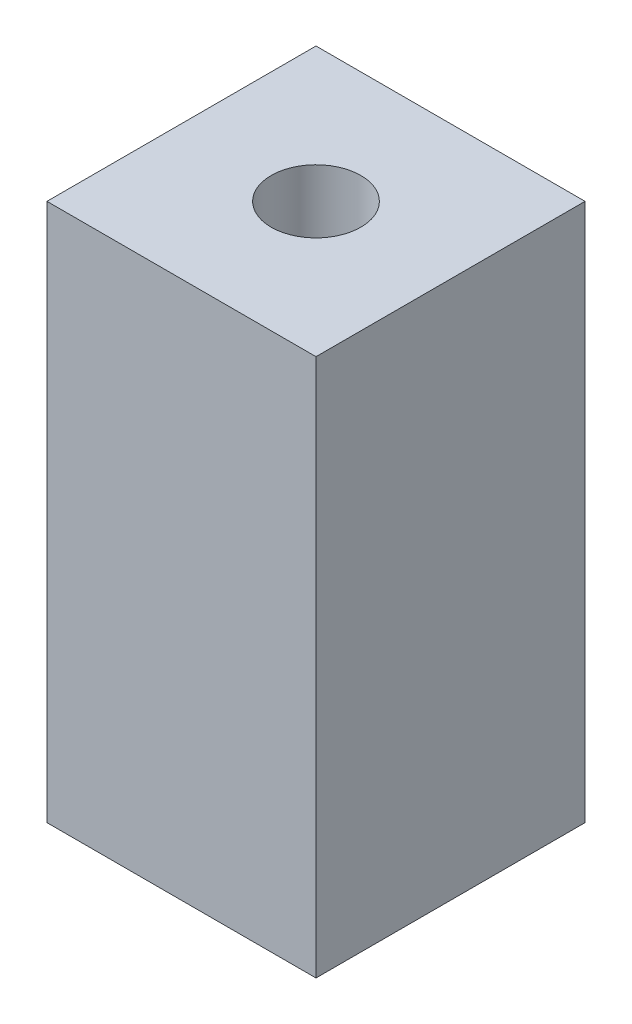
ISO-10303-21;
HEADER;
FILE_DESCRIPTION(('STEP AP214'),'2;1');
FILE_NAME('part.step','',(''),(''),'','','');
FILE_SCHEMA(('AUTOMOTIVE_DESIGN { 1 0 10303 214 1 1 1 1 }'));
ENDSEC;
DATA;
#1=APPLICATION_CONTEXT('core data for automotive mechanical design processes');
#2=APPLICATION_PROTOCOL_DEFINITION('international standard','automotive_design',2000,#1);
#3=PRODUCT_CONTEXT('',#1,'mechanical');
#4=PRODUCT('Part','Part','',(#3));
#5=PRODUCT_RELATED_PRODUCT_CATEGORY('part','',(#4));
#6=PRODUCT_DEFINITION_FORMATION('','',#4);
#7=PRODUCT_DEFINITION_CONTEXT('part definition',#1,'design');
#8=PRODUCT_DEFINITION('design','',#6,#7);
#9=PRODUCT_DEFINITION_SHAPE('','',#8);
#10=(LENGTH_UNIT() NAMED_UNIT(*) SI_UNIT(.MILLI.,.METRE.));
#11=(NAMED_UNIT(*) PLANE_ANGLE_UNIT() SI_UNIT($,.RADIAN.));
#12=(NAMED_UNIT(*) SI_UNIT($,.STERADIAN.) SOLID_ANGLE_UNIT());
#13=UNCERTAINTY_MEASURE_WITH_UNIT(LENGTH_MEASURE(1.E-05),#10,'distance_accuracy_value','');
#14=(GEOMETRIC_REPRESENTATION_CONTEXT(3) GLOBAL_UNCERTAINTY_ASSIGNED_CONTEXT((#13)) GLOBAL_UNIT_ASSIGNED_CONTEXT((#10,
#11,#12)) REPRESENTATION_CONTEXT('',''));
#15=CARTESIAN_POINT('',(0.,0.,0.));
#16=DIRECTION('',(0.,0.,1.));
#17=DIRECTION('',(1.,0.,0.));
#18=AXIS2_PLACEMENT_3D('',#15,#16,#17);
#19=CARTESIAN_POINT('',(0.,38.1,0.));
#20=DIRECTION('',(0.,1.,0.));
#21=DIRECTION('',(0.,0.,1.));
#22=AXIS2_PLACEMENT_3D('',#19,#20,#21);
#23=PLANE('',#22);
#24=DIRECTION('',(0.,0.,1.));
#25=VECTOR('',#24,1.);
#26=CARTESIAN_POINT('',(-9.52499999999999,38.1,9.525));
#27=LINE('',#26,#25);
#28=CARTESIAN_POINT('',(-9.52499999999999,38.1,-9.525));
#29=VERTEX_POINT('',#28);
#30=CARTESIAN_POINT('',(-9.52499999999999,38.1,9.525));
#31=VERTEX_POINT('',#30);
#32=EDGE_CURVE('E84',#29,#31,#27,.T.);
#33=ORIENTED_EDGE('',*,*,#32,.T.);
#34=DIRECTION('',(1.,0.,0.));
#35=VECTOR('',#34,1.);
#36=CARTESIAN_POINT('',(9.52500000000001,38.1,9.525));
#37=LINE('',#36,#35);
#38=CARTESIAN_POINT('',(9.52500000000001,38.1,9.525));
#39=VERTEX_POINT('',#38);
#40=EDGE_CURVE('E79',#31,#39,#37,.T.);
#41=ORIENTED_EDGE('',*,*,#40,.T.);
#42=DIRECTION('',(0.,0.,-1.));
#43=VECTOR('',#42,1.);
#44=CARTESIAN_POINT('',(9.52500000000001,38.1,9.525));
#45=LINE('',#44,#43);
#46=CARTESIAN_POINT('',(9.52500000000001,38.1,-9.525));
#47=VERTEX_POINT('',#46);
#48=EDGE_CURVE('E82',#39,#47,#45,.T.);
#49=ORIENTED_EDGE('',*,*,#48,.T.);
#50=DIRECTION('',(-1.,0.,0.));
#51=VECTOR('',#50,1.);
#52=CARTESIAN_POINT('',(9.52500000000001,38.1,-9.525));
#53=LINE('',#52,#51);
#54=EDGE_CURVE('E49',#47,#29,#53,.T.);
#55=ORIENTED_EDGE('',*,*,#54,.T.);
#56=EDGE_LOOP('',(#33,#41,#49,#55));
#57=FACE_BOUND('',#56,.T.);
#58=CARTESIAN_POINT('',(0.,38.1,0.));
#59=DIRECTION('',(0.,1.,0.));
#60=DIRECTION('',(0.,0.,1.));
#61=AXIS2_PLACEMENT_3D('',#58,#59,#60);
#62=CIRCLE('',#61,3.175);
#63=CARTESIAN_POINT('',(0.,38.1,3.175));
#64=VERTEX_POINT('',#63);
#65=EDGE_CURVE('E99',#64,#64,#62,.T.);
#66=ORIENTED_EDGE('',*,*,#65,.F.);
#67=EDGE_LOOP('',(#66));
#68=FACE_BOUND('',#67,.T.);
#69=ADVANCED_FACE('F32',(#57,#68),#23,.T.);
#70=CARTESIAN_POINT('',(0.,0.,0.));
#71=DIRECTION('',(0.,1.,0.));
#72=DIRECTION('',(0.,0.,1.));
#73=AXIS2_PLACEMENT_3D('',#70,#71,#72);
#74=PLANE('',#73);
#75=DIRECTION('',(0.,0.,1.));
#76=VECTOR('',#75,1.);
#77=CARTESIAN_POINT('',(-9.52499999999999,0.,9.525));
#78=LINE('',#77,#76);
#79=CARTESIAN_POINT('',(-9.52499999999999,0.,-9.525));
#80=VERTEX_POINT('',#79);
#81=CARTESIAN_POINT('',(-9.52499999999999,0.,9.525));
#82=VERTEX_POINT('',#81);
#83=EDGE_CURVE('E96',#80,#82,#78,.T.);
#84=ORIENTED_EDGE('',*,*,#83,.F.);
#85=DIRECTION('',(-1.,0.,0.));
#86=VECTOR('',#85,1.);
#87=CARTESIAN_POINT('',(9.52500000000001,0.,-9.525));
#88=LINE('',#87,#86);
#89=CARTESIAN_POINT('',(9.52500000000001,0.,-9.525));
#90=VERTEX_POINT('',#89);
#91=EDGE_CURVE('E72',#90,#80,#88,.T.);
#92=ORIENTED_EDGE('',*,*,#91,.F.);
#93=DIRECTION('',(0.,0.,-1.));
#94=VECTOR('',#93,1.);
#95=CARTESIAN_POINT('',(9.52500000000001,0.,9.525));
#96=LINE('',#95,#94);
#97=CARTESIAN_POINT('',(9.52500000000001,0.,9.525));
#98=VERTEX_POINT('',#97);
#99=EDGE_CURVE('E66',#98,#90,#96,.T.);
#100=ORIENTED_EDGE('',*,*,#99,.F.);
#101=DIRECTION('',(1.,0.,0.));
#102=VECTOR('',#101,1.);
#103=CARTESIAN_POINT('',(9.52500000000001,0.,9.525));
#104=LINE('',#103,#102);
#105=EDGE_CURVE('E88',#82,#98,#104,.T.);
#106=ORIENTED_EDGE('',*,*,#105,.F.);
#107=EDGE_LOOP('',(#84,#92,#100,#106));
#108=FACE_BOUND('',#107,.T.);
#109=CARTESIAN_POINT('',(0.,0.,0.));
#110=DIRECTION('',(0.,1.,0.));
#111=DIRECTION('',(0.,0.,1.));
#112=AXIS2_PLACEMENT_3D('',#109,#110,#111);
#113=CIRCLE('',#112,3.175);
#114=CARTESIAN_POINT('',(0.,0.,3.175));
#115=VERTEX_POINT('',#114);
#116=EDGE_CURVE('E111',#115,#115,#113,.T.);
#117=ORIENTED_EDGE('',*,*,#116,.T.);
#118=EDGE_LOOP('',(#117));
#119=FACE_BOUND('',#118,.T.);
#120=ADVANCED_FACE('F107',(#108,#119),#74,.F.);
#121=CARTESIAN_POINT('',(-9.52499999999999,38.1,9.525));
#122=DIRECTION('',(1.,0.,0.));
#123=DIRECTION('',(0.,0.,-1.));
#124=AXIS2_PLACEMENT_3D('',#121,#122,#123);
#125=PLANE('',#124);
#126=ORIENTED_EDGE('',*,*,#83,.T.);
#127=DIRECTION('',(0.,-1.,0.));
#128=VECTOR('',#127,1.);
#129=CARTESIAN_POINT('',(-9.52499999999999,38.1,9.525));
#130=LINE('',#129,#128);
#131=EDGE_CURVE('E11',#31,#82,#130,.T.);
#132=ORIENTED_EDGE('',*,*,#131,.F.);
#133=ORIENTED_EDGE('',*,*,#32,.F.);
#134=DIRECTION('',(0.,-1.,0.));
#135=VECTOR('',#134,1.);
#136=CARTESIAN_POINT('',(-9.52499999999999,38.1,-9.525));
#137=LINE('',#136,#135);
#138=EDGE_CURVE('E92',#29,#80,#137,.T.);
#139=ORIENTED_EDGE('',*,*,#138,.T.);
#140=EDGE_LOOP('',(#126,#132,#133,#139));
#141=FACE_BOUND('',#140,.T.);
#142=ADVANCED_FACE('F34',(#141),#125,.F.);
#143=CARTESIAN_POINT('',(9.52500000000001,38.1,9.525));
#144=DIRECTION('',(0.,0.,-1.));
#145=DIRECTION('',(-1.,0.,0.));
#146=AXIS2_PLACEMENT_3D('',#143,#144,#145);
#147=PLANE('',#146);
#148=ORIENTED_EDGE('',*,*,#105,.T.);
#149=DIRECTION('',(0.,-1.,0.));
#150=VECTOR('',#149,1.);
#151=CARTESIAN_POINT('',(9.52500000000001,38.1,9.525));
#152=LINE('',#151,#150);
#153=EDGE_CURVE('E41',#39,#98,#152,.T.);
#154=ORIENTED_EDGE('',*,*,#153,.F.);
#155=ORIENTED_EDGE('',*,*,#40,.F.);
#156=ORIENTED_EDGE('',*,*,#131,.T.);
#157=EDGE_LOOP('',(#148,#154,#155,#156));
#158=FACE_BOUND('',#157,.T.);
#159=ADVANCED_FACE('F87',(#158),#147,.F.);
#160=CARTESIAN_POINT('',(9.52500000000001,38.1,9.525));
#161=DIRECTION('',(-1.,0.,0.));
#162=DIRECTION('',(0.,0.,1.));
#163=AXIS2_PLACEMENT_3D('',#160,#161,#162);
#164=PLANE('',#163);
#165=ORIENTED_EDGE('',*,*,#99,.T.);
#166=DIRECTION('',(0.,-1.,0.));
#167=VECTOR('',#166,1.);
#168=CARTESIAN_POINT('',(9.52500000000001,38.1,-9.525));
#169=LINE('',#168,#167);
#170=EDGE_CURVE('E89',#47,#90,#169,.T.);
#171=ORIENTED_EDGE('',*,*,#170,.F.);
#172=ORIENTED_EDGE('',*,*,#48,.F.);
#173=ORIENTED_EDGE('',*,*,#153,.T.);
#174=EDGE_LOOP('',(#165,#171,#172,#173));
#175=FACE_BOUND('',#174,.T.);
#176=ADVANCED_FACE('F90',(#175),#164,.F.);
#177=CARTESIAN_POINT('',(9.52500000000001,38.1,-9.525));
#178=DIRECTION('',(0.,0.,1.));
#179=DIRECTION('',(1.,0.,0.));
#180=AXIS2_PLACEMENT_3D('',#177,#178,#179);
#181=PLANE('',#180);
#182=ORIENTED_EDGE('',*,*,#91,.T.);
#183=ORIENTED_EDGE('',*,*,#138,.F.);
#184=ORIENTED_EDGE('',*,*,#54,.F.);
#185=ORIENTED_EDGE('',*,*,#170,.T.);
#186=EDGE_LOOP('',(#182,#183,#184,#185));
#187=FACE_BOUND('',#186,.T.);
#188=ADVANCED_FACE('F104',(#187),#181,.F.);
#189=CARTESIAN_POINT('',(0.,38.1,0.));
#190=DIRECTION('',(0.,-1.,0.));
#191=DIRECTION('',(0.,0.,-1.));
#192=AXIS2_PLACEMENT_3D('',#189,#190,#191);
#193=CYLINDRICAL_SURFACE('',#192,3.175);
#194=ORIENTED_EDGE('',*,*,#65,.T.);
#195=EDGE_LOOP('',(#194));
#196=FACE_BOUND('',#195,.T.);
#197=ORIENTED_EDGE('',*,*,#116,.F.);
#198=EDGE_LOOP('',(#197));
#199=FACE_BOUND('',#198,.T.);
#200=ADVANCED_FACE('F117',(#196,#199),#193,.F.);
#201=CLOSED_SHELL('',(#69,#120,#142,#159,#176,#188,#200));
#202=MANIFOLD_SOLID_BREP('B2',#201);
#203=ADVANCED_BREP_SHAPE_REPRESENTATION('',(#18,#202),#14);
#204=SHAPE_DEFINITION_REPRESENTATION(#9,#203);
ENDSEC;
END-ISO-10303-21;
